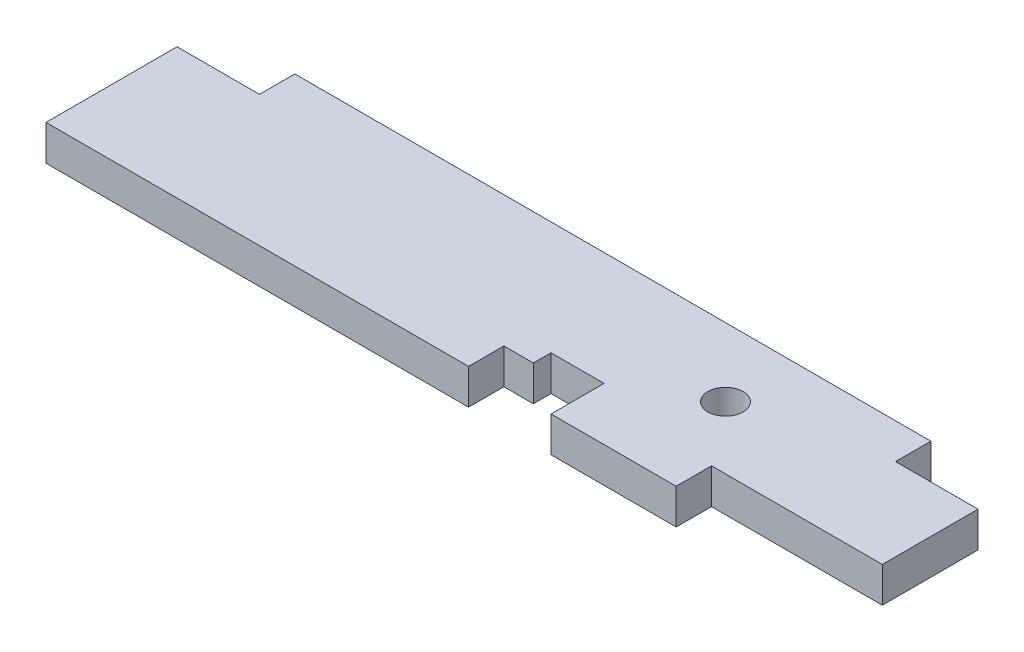
ISO-10303-21;
HEADER;
FILE_DESCRIPTION(('STEP AP214'),'2;1');
FILE_NAME('part.step','',(''),(''),'','','');
FILE_SCHEMA(('AUTOMOTIVE_DESIGN { 1 0 10303 214 1 1 1 1 }'));
ENDSEC;
DATA;
#1=APPLICATION_CONTEXT('core data for automotive mechanical design processes');
#2=APPLICATION_PROTOCOL_DEFINITION('international standard','automotive_design',2000,#1);
#3=PRODUCT_CONTEXT('',#1,'mechanical');
#4=PRODUCT('Part','Part','',(#3));
#5=PRODUCT_RELATED_PRODUCT_CATEGORY('part','',(#4));
#6=PRODUCT_DEFINITION_FORMATION('','',#4);
#7=PRODUCT_DEFINITION_CONTEXT('part definition',#1,'design');
#8=PRODUCT_DEFINITION('design','',#6,#7);
#9=PRODUCT_DEFINITION_SHAPE('','',#8);
#10=(LENGTH_UNIT() NAMED_UNIT(*) SI_UNIT(.MILLI.,.METRE.));
#11=(NAMED_UNIT(*) PLANE_ANGLE_UNIT() SI_UNIT($,.RADIAN.));
#12=(NAMED_UNIT(*) SI_UNIT($,.STERADIAN.) SOLID_ANGLE_UNIT());
#13=UNCERTAINTY_MEASURE_WITH_UNIT(LENGTH_MEASURE(1.E-05),#10,'distance_accuracy_value','');
#14=(GEOMETRIC_REPRESENTATION_CONTEXT(3) GLOBAL_UNCERTAINTY_ASSIGNED_CONTEXT((#13)) GLOBAL_UNIT_ASSIGNED_CONTEXT((#10,
#11,#12)) REPRESENTATION_CONTEXT('',''));
#15=CARTESIAN_POINT('',(0.,0.,0.));
#16=DIRECTION('',(0.,0.,1.));
#17=DIRECTION('',(1.,0.,0.));
#18=AXIS2_PLACEMENT_3D('',#15,#16,#17);
#19=CARTESIAN_POINT('',(0.,38.1,179.3875));
#20=DIRECTION('',(0.,0.,-1.));
#21=DIRECTION('',(-1.,0.,0.));
#22=AXIS2_PLACEMENT_3D('',#19,#20,#21);
#23=PLANE('',#22);
#24=DIRECTION('',(1.,0.,0.));
#25=VECTOR('',#24,1.);
#26=CARTESIAN_POINT('',(0.,0.,179.3875));
#27=LINE('',#26,#25);
#28=CARTESIAN_POINT('',(0.,0.,179.3875));
#29=VERTEX_POINT('',#28);
#30=CARTESIAN_POINT('',(455.6125,0.,179.3875));
#31=VERTEX_POINT('',#30);
#32=EDGE_CURVE('E298',#29,#31,#27,.T.);
#33=ORIENTED_EDGE('',*,*,#32,.T.);
#34=DIRECTION('',(0.,1.,0.));
#35=VECTOR('',#34,1.);
#36=CARTESIAN_POINT('',(455.6125,0.,179.3875));
#37=LINE('',#36,#35);
#38=CARTESIAN_POINT('',(455.6125,38.1,179.3875));
#39=VERTEX_POINT('',#38);
#40=EDGE_CURVE('E229',#31,#39,#37,.T.);
#41=ORIENTED_EDGE('',*,*,#40,.T.);
#42=DIRECTION('',(1.,0.,0.));
#43=VECTOR('',#42,1.);
#44=CARTESIAN_POINT('',(0.,38.1,179.3875));
#45=LINE('',#44,#43);
#46=CARTESIAN_POINT('',(0.,38.1,179.3875));
#47=VERTEX_POINT('',#46);
#48=EDGE_CURVE('E279',#47,#39,#45,.T.);
#49=ORIENTED_EDGE('',*,*,#48,.F.);
#50=DIRECTION('',(0.,-1.,0.));
#51=VECTOR('',#50,1.);
#52=CARTESIAN_POINT('',(0.,38.1,179.3875));
#53=LINE('',#52,#51);
#54=EDGE_CURVE('E11',#47,#29,#53,.T.);
#55=ORIENTED_EDGE('',*,*,#54,.T.);
#56=EDGE_LOOP('',(#33,#41,#49,#55));
#57=FACE_BOUND('',#56,.T.);
#58=ADVANCED_FACE('F43',(#57),#23,.F.);
#59=CARTESIAN_POINT('',(0.,38.1,0.));
#60=DIRECTION('',(0.,1.,0.));
#61=DIRECTION('',(0.,0.,1.));
#62=AXIS2_PLACEMENT_3D('',#59,#60,#61);
#63=PLANE('',#62);
#64=DIRECTION('',(-1.,0.,0.));
#65=VECTOR('',#64,1.);
#66=CARTESIAN_POINT('',(0.,38.1,38.1));
#67=LINE('',#66,#65);
#68=CARTESIAN_POINT('',(88.9,38.1,38.1));
#69=VERTEX_POINT('',#68);
#70=CARTESIAN_POINT('',(0.,38.1,38.1));
#71=VERTEX_POINT('',#70);
#72=EDGE_CURVE('E166',#69,#71,#67,.T.);
#73=ORIENTED_EDGE('',*,*,#72,.T.);
#74=DIRECTION('',(0.,0.,1.));
#75=VECTOR('',#74,1.);
#76=CARTESIAN_POINT('',(0.,38.1,0.));
#77=LINE('',#76,#75);
#78=EDGE_CURVE('E274',#71,#47,#77,.T.);
#79=ORIENTED_EDGE('',*,*,#78,.T.);
#80=ORIENTED_EDGE('',*,*,#48,.T.);
#81=DIRECTION('',(0.,0.,1.));
#82=VECTOR('',#81,1.);
#83=CARTESIAN_POINT('',(455.6125,38.1,141.2875));
#84=LINE('',#83,#82);
#85=CARTESIAN_POINT('',(455.6125,38.1,141.2875));
#86=VERTEX_POINT('',#85);
#87=EDGE_CURVE('E201',#86,#39,#84,.T.);
#88=ORIENTED_EDGE('',*,*,#87,.F.);
#89=DIRECTION('',(-1.,0.,0.));
#90=VECTOR('',#89,1.);
#91=CARTESIAN_POINT('',(455.6125,38.1,141.2875));
#92=LINE('',#91,#90);
#93=CARTESIAN_POINT('',(487.3625,38.1,141.2875));
#94=VERTEX_POINT('',#93);
#95=EDGE_CURVE('E213',#94,#86,#92,.T.);
#96=ORIENTED_EDGE('',*,*,#95,.F.);
#97=DIRECTION('',(0.,0.,1.));
#98=VECTOR('',#97,1.);
#99=CARTESIAN_POINT('',(487.3625,38.1,141.2875));
#100=LINE('',#99,#98);
#101=CARTESIAN_POINT('',(487.3625,38.1,122.2375));
#102=VERTEX_POINT('',#101);
#103=EDGE_CURVE('E240',#102,#94,#100,.T.);
#104=ORIENTED_EDGE('',*,*,#103,.F.);
#105=DIRECTION('',(-1.,0.,0.));
#106=VECTOR('',#105,1.);
#107=CARTESIAN_POINT('',(544.5125,38.1,122.2375));
#108=LINE('',#107,#106);
#109=CARTESIAN_POINT('',(544.5125,38.1,122.2375));
#110=VERTEX_POINT('',#109);
#111=EDGE_CURVE('E236',#110,#102,#108,.T.);
#112=ORIENTED_EDGE('',*,*,#111,.F.);
#113=DIRECTION('',(0.,0.,-1.));
#114=VECTOR('',#113,1.);
#115=CARTESIAN_POINT('',(544.5125,38.1,179.3875));
#116=LINE('',#115,#114);
#117=CARTESIAN_POINT('',(544.5125,38.1,179.3875));
#118=VERTEX_POINT('',#117);
#119=EDGE_CURVE('E232',#118,#110,#116,.T.);
#120=ORIENTED_EDGE('',*,*,#119,.F.);
#121=CARTESIAN_POINT('',(679.45,38.1,179.3875));
#122=VERTEX_POINT('',#121);
#123=EDGE_CURVE('E277',#118,#122,#45,.T.);
#124=ORIENTED_EDGE('',*,*,#123,.T.);
#125=DIRECTION('',(0.,0.,1.));
#126=VECTOR('',#125,1.);
#127=CARTESIAN_POINT('',(679.45,38.1,179.3875));
#128=LINE('',#127,#126);
#129=CARTESIAN_POINT('',(679.45,38.1,141.2748));
#130=VERTEX_POINT('',#129);
#131=EDGE_CURVE('E182',#130,#122,#128,.T.);
#132=ORIENTED_EDGE('',*,*,#131,.F.);
#133=DIRECTION('',(-1.,0.,0.));
#134=VECTOR('',#133,1.);
#135=CARTESIAN_POINT('',(679.45,38.1,141.2748));
#136=LINE('',#135,#134);
#137=CARTESIAN_POINT('',(863.6,38.1,141.2748));
#138=VERTEX_POINT('',#137);
#139=EDGE_CURVE('E189',#138,#130,#136,.T.);
#140=ORIENTED_EDGE('',*,*,#139,.F.);
#141=DIRECTION('',(0.,0.,-1.));
#142=VECTOR('',#141,1.);
#143=CARTESIAN_POINT('',(863.6,38.1,38.1));
#144=LINE('',#143,#142);
#145=CARTESIAN_POINT('',(863.6,38.1,38.1));
#146=VERTEX_POINT('',#145);
#147=EDGE_CURVE('E283',#138,#146,#144,.T.);
#148=ORIENTED_EDGE('',*,*,#147,.T.);
#149=DIRECTION('',(-1.,0.,0.));
#150=VECTOR('',#149,1.);
#151=CARTESIAN_POINT('',(774.7,38.1,38.1));
#152=LINE('',#151,#150);
#153=CARTESIAN_POINT('',(774.7,38.1,38.1));
#154=VERTEX_POINT('',#153);
#155=EDGE_CURVE('E286',#146,#154,#152,.T.);
#156=ORIENTED_EDGE('',*,*,#155,.T.);
#157=DIRECTION('',(0.,0.,-1.));
#158=VECTOR('',#157,1.);
#159=CARTESIAN_POINT('',(774.7,38.1,0.));
#160=LINE('',#159,#158);
#161=CARTESIAN_POINT('',(774.7,38.1,0.));
#162=VERTEX_POINT('',#161);
#163=EDGE_CURVE('E289',#154,#162,#160,.T.);
#164=ORIENTED_EDGE('',*,*,#163,.T.);
#165=DIRECTION('',(-1.,0.,0.));
#166=VECTOR('',#165,1.);
#167=CARTESIAN_POINT('',(0.,38.1,0.));
#168=LINE('',#167,#166);
#169=CARTESIAN_POINT('',(88.9,38.1,0.));
#170=VERTEX_POINT('',#169);
#171=EDGE_CURVE('E176',#162,#170,#168,.T.);
#172=ORIENTED_EDGE('',*,*,#171,.T.);
#173=DIRECTION('',(0.,0.,1.));
#174=VECTOR('',#173,1.);
#175=CARTESIAN_POINT('',(88.9,38.1,0.));
#176=LINE('',#175,#174);
#177=EDGE_CURVE('E59',#170,#69,#176,.T.);
#178=ORIENTED_EDGE('',*,*,#177,.T.);
#179=EDGE_LOOP('',(#73,#79,#80,#88,#96,#104,#112,#120,#124,#132,#140,#148,#156,#164,#172,#178));
#180=FACE_BOUND('',#179,.T.);
#181=CARTESIAN_POINT('',(627.126,38.1,73.914));
#182=DIRECTION('',(0.,1.,0.));
#183=DIRECTION('',(0.,0.,1.));
#184=AXIS2_PLACEMENT_3D('',#181,#182,#183);
#185=CIRCLE('',#184,19.05);
#186=CARTESIAN_POINT('',(627.126,38.1,92.964));
#187=VERTEX_POINT('',#186);
#188=EDGE_CURVE('E266',#187,#187,#185,.T.);
#189=ORIENTED_EDGE('',*,*,#188,.F.);
#190=EDGE_LOOP('',(#189));
#191=FACE_BOUND('',#190,.T.);
#192=ADVANCED_FACE('F173',(#180,#191),#63,.T.);
#193=CARTESIAN_POINT('',(0.,0.,0.));
#194=DIRECTION('',(0.,1.,0.));
#195=DIRECTION('',(0.,0.,1.));
#196=AXIS2_PLACEMENT_3D('',#193,#194,#195);
#197=PLANE('',#196);
#198=DIRECTION('',(0.,0.,1.));
#199=VECTOR('',#198,1.);
#200=CARTESIAN_POINT('',(0.,0.,0.));
#201=LINE('',#200,#199);
#202=CARTESIAN_POINT('',(0.,0.,38.1));
#203=VERTEX_POINT('',#202);
#204=EDGE_CURVE('E270',#203,#29,#201,.T.);
#205=ORIENTED_EDGE('',*,*,#204,.F.);
#206=DIRECTION('',(-1.,0.,0.));
#207=VECTOR('',#206,1.);
#208=CARTESIAN_POINT('',(0.,0.,38.1));
#209=LINE('',#208,#207);
#210=CARTESIAN_POINT('',(88.9,0.,38.1));
#211=VERTEX_POINT('',#210);
#212=EDGE_CURVE('E177',#211,#203,#209,.T.);
#213=ORIENTED_EDGE('',*,*,#212,.F.);
#214=DIRECTION('',(0.,0.,1.));
#215=VECTOR('',#214,1.);
#216=CARTESIAN_POINT('',(88.9,0.,0.));
#217=LINE('',#216,#215);
#218=CARTESIAN_POINT('',(88.9,0.,0.));
#219=VERTEX_POINT('',#218);
#220=EDGE_CURVE('E159',#219,#211,#217,.T.);
#221=ORIENTED_EDGE('',*,*,#220,.F.);
#222=DIRECTION('',(-1.,0.,0.));
#223=VECTOR('',#222,1.);
#224=CARTESIAN_POINT('',(0.,0.,0.));
#225=LINE('',#224,#223);
#226=CARTESIAN_POINT('',(774.7,0.,0.));
#227=VERTEX_POINT('',#226);
#228=EDGE_CURVE('E278',#227,#219,#225,.T.);
#229=ORIENTED_EDGE('',*,*,#228,.F.);
#230=DIRECTION('',(0.,0.,-1.));
#231=VECTOR('',#230,1.);
#232=CARTESIAN_POINT('',(774.7,0.,0.));
#233=LINE('',#232,#231);
#234=CARTESIAN_POINT('',(774.7,0.,38.1));
#235=VERTEX_POINT('',#234);
#236=EDGE_CURVE('E308',#235,#227,#233,.T.);
#237=ORIENTED_EDGE('',*,*,#236,.F.);
#238=DIRECTION('',(-1.,0.,0.));
#239=VECTOR('',#238,1.);
#240=CARTESIAN_POINT('',(774.7,0.,38.1));
#241=LINE('',#240,#239);
#242=CARTESIAN_POINT('',(863.6,0.,38.1));
#243=VERTEX_POINT('',#242);
#244=EDGE_CURVE('E305',#243,#235,#241,.T.);
#245=ORIENTED_EDGE('',*,*,#244,.F.);
#246=DIRECTION('',(0.,0.,-1.));
#247=VECTOR('',#246,1.);
#248=CARTESIAN_POINT('',(863.6,0.,38.1));
#249=LINE('',#248,#247);
#250=CARTESIAN_POINT('',(863.6,0.,141.2748));
#251=VERTEX_POINT('',#250);
#252=EDGE_CURVE('E302',#251,#243,#249,.T.);
#253=ORIENTED_EDGE('',*,*,#252,.F.);
#254=DIRECTION('',(-1.,0.,0.));
#255=VECTOR('',#254,1.);
#256=CARTESIAN_POINT('',(679.45,0.,141.2748));
#257=LINE('',#256,#255);
#258=CARTESIAN_POINT('',(679.45,0.,141.2748));
#259=VERTEX_POINT('',#258);
#260=EDGE_CURVE('E67',#251,#259,#257,.T.);
#261=ORIENTED_EDGE('',*,*,#260,.T.);
#262=DIRECTION('',(0.,0.,1.));
#263=VECTOR('',#262,1.);
#264=CARTESIAN_POINT('',(679.45,0.,179.3875));
#265=LINE('',#264,#263);
#266=CARTESIAN_POINT('',(679.45,0.,179.3875));
#267=VERTEX_POINT('',#266);
#268=EDGE_CURVE('E185',#259,#267,#265,.T.);
#269=ORIENTED_EDGE('',*,*,#268,.T.);
#270=CARTESIAN_POINT('',(544.5125,0.,179.3875));
#271=VERTEX_POINT('',#270);
#272=EDGE_CURVE('E297',#271,#267,#27,.T.);
#273=ORIENTED_EDGE('',*,*,#272,.F.);
#274=DIRECTION('',(0.,0.,-1.));
#275=VECTOR('',#274,1.);
#276=CARTESIAN_POINT('',(544.5125,0.,179.3875));
#277=LINE('',#276,#275);
#278=CARTESIAN_POINT('',(544.5125,0.,122.2375));
#279=VERTEX_POINT('',#278);
#280=EDGE_CURVE('E212',#271,#279,#277,.T.);
#281=ORIENTED_EDGE('',*,*,#280,.T.);
#282=DIRECTION('',(-1.,0.,0.));
#283=VECTOR('',#282,1.);
#284=CARTESIAN_POINT('',(544.5125,0.,122.2375));
#285=LINE('',#284,#283);
#286=CARTESIAN_POINT('',(487.3625,0.,122.2375));
#287=VERTEX_POINT('',#286);
#288=EDGE_CURVE('E217',#279,#287,#285,.T.);
#289=ORIENTED_EDGE('',*,*,#288,.T.);
#290=DIRECTION('',(0.,0.,1.));
#291=VECTOR('',#290,1.);
#292=CARTESIAN_POINT('',(487.3625,0.,141.2875));
#293=LINE('',#292,#291);
#294=CARTESIAN_POINT('',(487.3625,0.,141.2875));
#295=VERTEX_POINT('',#294);
#296=EDGE_CURVE('E221',#287,#295,#293,.T.);
#297=ORIENTED_EDGE('',*,*,#296,.T.);
#298=DIRECTION('',(-1.,0.,0.));
#299=VECTOR('',#298,1.);
#300=CARTESIAN_POINT('',(455.6125,0.,141.2875));
#301=LINE('',#300,#299);
#302=CARTESIAN_POINT('',(455.6125,0.,141.2875));
#303=VERTEX_POINT('',#302);
#304=EDGE_CURVE('E225',#295,#303,#301,.T.);
#305=ORIENTED_EDGE('',*,*,#304,.T.);
#306=DIRECTION('',(0.,0.,1.));
#307=VECTOR('',#306,1.);
#308=CARTESIAN_POINT('',(455.6125,0.,141.2875));
#309=LINE('',#308,#307);
#310=EDGE_CURVE('E208',#303,#31,#309,.T.);
#311=ORIENTED_EDGE('',*,*,#310,.T.);
#312=ORIENTED_EDGE('',*,*,#32,.F.);
#313=EDGE_LOOP('',(#205,#213,#221,#229,#237,#245,#253,#261,#269,#273,#281,#289,#297,#305,#311,#312));
#314=FACE_BOUND('',#313,.T.);
#315=CARTESIAN_POINT('',(627.126,0.,73.914));
#316=DIRECTION('',(0.,1.,0.));
#317=DIRECTION('',(0.,0.,1.));
#318=AXIS2_PLACEMENT_3D('',#315,#316,#317);
#319=CIRCLE('',#318,19.05);
#320=CARTESIAN_POINT('',(627.126,0.,92.964));
#321=VERTEX_POINT('',#320);
#322=EDGE_CURVE('E250',#321,#321,#319,.T.);
#323=ORIENTED_EDGE('',*,*,#322,.T.);
#324=EDGE_LOOP('',(#323));
#325=FACE_BOUND('',#324,.T.);
#326=ADVANCED_FACE('F335',(#314,#325),#197,.F.);
#327=CARTESIAN_POINT('',(0.,38.1,0.));
#328=DIRECTION('',(1.,0.,0.));
#329=DIRECTION('',(0.,0.,-1.));
#330=AXIS2_PLACEMENT_3D('',#327,#328,#329);
#331=PLANE('',#330);
#332=ORIENTED_EDGE('',*,*,#78,.F.);
#333=DIRECTION('',(0.,-1.,0.));
#334=VECTOR('',#333,1.);
#335=CARTESIAN_POINT('',(0.,38.1,38.1));
#336=LINE('',#335,#334);
#337=EDGE_CURVE('E162',#71,#203,#336,.T.);
#338=ORIENTED_EDGE('',*,*,#337,.T.);
#339=ORIENTED_EDGE('',*,*,#204,.T.);
#340=ORIENTED_EDGE('',*,*,#54,.F.);
#341=EDGE_LOOP('',(#332,#338,#339,#340));
#342=FACE_BOUND('',#341,.T.);
#343=ADVANCED_FACE('F45',(#342),#331,.F.);
#344=ORIENTED_EDGE('',*,*,#272,.T.);
#345=DIRECTION('',(0.,1.,0.));
#346=VECTOR('',#345,1.);
#347=CARTESIAN_POINT('',(679.45,0.,179.3875));
#348=LINE('',#347,#346);
#349=EDGE_CURVE('E192',#267,#122,#348,.T.);
#350=ORIENTED_EDGE('',*,*,#349,.T.);
#351=ORIENTED_EDGE('',*,*,#123,.F.);
#352=DIRECTION('',(0.,1.,0.));
#353=VECTOR('',#352,1.);
#354=CARTESIAN_POINT('',(544.5125,0.,179.3875));
#355=LINE('',#354,#353);
#356=EDGE_CURVE('E260',#271,#118,#355,.T.);
#357=ORIENTED_EDGE('',*,*,#356,.F.);
#358=EDGE_LOOP('',(#344,#350,#351,#357));
#359=FACE_BOUND('',#358,.T.);
#360=ADVANCED_FACE('F374',(#359),#23,.F.);
#361=CARTESIAN_POINT('',(863.6,38.1,38.1));
#362=DIRECTION('',(-1.,0.,0.));
#363=DIRECTION('',(0.,0.,1.));
#364=AXIS2_PLACEMENT_3D('',#361,#362,#363);
#365=PLANE('',#364);
#366=ORIENTED_EDGE('',*,*,#147,.F.);
#367=DIRECTION('',(0.,1.,0.));
#368=VECTOR('',#367,1.);
#369=CARTESIAN_POINT('',(863.6,0.,141.2748));
#370=LINE('',#369,#368);
#371=EDGE_CURVE('E202',#251,#138,#370,.T.);
#372=ORIENTED_EDGE('',*,*,#371,.F.);
#373=ORIENTED_EDGE('',*,*,#252,.T.);
#374=DIRECTION('',(0.,-1.,0.));
#375=VECTOR('',#374,1.);
#376=CARTESIAN_POINT('',(863.6,38.1,38.1));
#377=LINE('',#376,#375);
#378=EDGE_CURVE('E52',#146,#243,#377,.T.);
#379=ORIENTED_EDGE('',*,*,#378,.F.);
#380=EDGE_LOOP('',(#366,#372,#373,#379));
#381=FACE_BOUND('',#380,.T.);
#382=ADVANCED_FACE('F417',(#381),#365,.F.);
#383=CARTESIAN_POINT('',(774.7,38.1,38.1));
#384=DIRECTION('',(0.,0.,1.));
#385=DIRECTION('',(1.,0.,0.));
#386=AXIS2_PLACEMENT_3D('',#383,#384,#385);
#387=PLANE('',#386);
#388=ORIENTED_EDGE('',*,*,#244,.T.);
#389=DIRECTION('',(0.,-1.,0.));
#390=VECTOR('',#389,1.);
#391=CARTESIAN_POINT('',(774.7,38.1,38.1));
#392=LINE('',#391,#390);
#393=EDGE_CURVE('E317',#154,#235,#392,.T.);
#394=ORIENTED_EDGE('',*,*,#393,.F.);
#395=ORIENTED_EDGE('',*,*,#155,.F.);
#396=ORIENTED_EDGE('',*,*,#378,.T.);
#397=EDGE_LOOP('',(#388,#394,#395,#396));
#398=FACE_BOUND('',#397,.T.);
#399=ADVANCED_FACE('F327',(#398),#387,.F.);
#400=CARTESIAN_POINT('',(774.7,38.1,0.));
#401=DIRECTION('',(-1.,0.,0.));
#402=DIRECTION('',(0.,0.,1.));
#403=AXIS2_PLACEMENT_3D('',#400,#401,#402);
#404=PLANE('',#403);
#405=ORIENTED_EDGE('',*,*,#236,.T.);
#406=DIRECTION('',(0.,-1.,0.));
#407=VECTOR('',#406,1.);
#408=CARTESIAN_POINT('',(774.7,38.1,0.));
#409=LINE('',#408,#407);
#410=EDGE_CURVE('E294',#162,#227,#409,.T.);
#411=ORIENTED_EDGE('',*,*,#410,.F.);
#412=ORIENTED_EDGE('',*,*,#163,.F.);
#413=ORIENTED_EDGE('',*,*,#393,.T.);
#414=EDGE_LOOP('',(#405,#411,#412,#413));
#415=FACE_BOUND('',#414,.T.);
#416=ADVANCED_FACE('F340',(#415),#404,.F.);
#417=CARTESIAN_POINT('',(0.,38.1,0.));
#418=DIRECTION('',(0.,0.,1.));
#419=DIRECTION('',(1.,0.,0.));
#420=AXIS2_PLACEMENT_3D('',#417,#418,#419);
#421=PLANE('',#420);
#422=ORIENTED_EDGE('',*,*,#228,.T.);
#423=DIRECTION('',(0.,-1.,0.));
#424=VECTOR('',#423,1.);
#425=CARTESIAN_POINT('',(88.9,38.1,0.));
#426=LINE('',#425,#424);
#427=EDGE_CURVE('E163',#170,#219,#426,.T.);
#428=ORIENTED_EDGE('',*,*,#427,.F.);
#429=ORIENTED_EDGE('',*,*,#171,.F.);
#430=ORIENTED_EDGE('',*,*,#410,.T.);
#431=EDGE_LOOP('',(#422,#428,#429,#430));
#432=FACE_BOUND('',#431,.T.);
#433=ADVANCED_FACE('F343',(#432),#421,.F.);
#434=CARTESIAN_POINT('',(627.126,38.1,73.914));
#435=DIRECTION('',(0.,-1.,0.));
#436=DIRECTION('',(0.,0.,-1.));
#437=AXIS2_PLACEMENT_3D('',#434,#435,#436);
#438=CYLINDRICAL_SURFACE('',#437,19.05);
#439=ORIENTED_EDGE('',*,*,#188,.T.);
#440=EDGE_LOOP('',(#439));
#441=FACE_BOUND('',#440,.T.);
#442=ORIENTED_EDGE('',*,*,#322,.F.);
#443=EDGE_LOOP('',(#442));
#444=FACE_BOUND('',#443,.T.);
#445=ADVANCED_FACE('F452',(#441,#444),#438,.F.);
#446=CARTESIAN_POINT('',(455.6125,0.,141.2875));
#447=DIRECTION('',(-1.,0.,0.));
#448=DIRECTION('',(0.,0.,1.));
#449=AXIS2_PLACEMENT_3D('',#446,#447,#448);
#450=PLANE('',#449);
#451=ORIENTED_EDGE('',*,*,#87,.T.);
#452=ORIENTED_EDGE('',*,*,#40,.F.);
#453=ORIENTED_EDGE('',*,*,#310,.F.);
#454=DIRECTION('',(0.,1.,0.));
#455=VECTOR('',#454,1.);
#456=CARTESIAN_POINT('',(455.6125,0.,141.2875));
#457=LINE('',#456,#455);
#458=EDGE_CURVE('E247',#303,#86,#457,.T.);
#459=ORIENTED_EDGE('',*,*,#458,.T.);
#460=EDGE_LOOP('',(#451,#452,#453,#459));
#461=FACE_BOUND('',#460,.T.);
#462=ADVANCED_FACE('F352',(#461),#450,.F.);
#463=CARTESIAN_POINT('',(455.6125,0.,141.2875));
#464=DIRECTION('',(0.,0.,-1.));
#465=DIRECTION('',(-1.,0.,0.));
#466=AXIS2_PLACEMENT_3D('',#463,#464,#465);
#467=PLANE('',#466);
#468=ORIENTED_EDGE('',*,*,#95,.T.);
#469=ORIENTED_EDGE('',*,*,#458,.F.);
#470=ORIENTED_EDGE('',*,*,#304,.F.);
#471=DIRECTION('',(0.,1.,0.));
#472=VECTOR('',#471,1.);
#473=CARTESIAN_POINT('',(487.3625,0.,141.2875));
#474=LINE('',#473,#472);
#475=EDGE_CURVE('E251',#295,#94,#474,.T.);
#476=ORIENTED_EDGE('',*,*,#475,.T.);
#477=EDGE_LOOP('',(#468,#469,#470,#476));
#478=FACE_BOUND('',#477,.T.);
#479=ADVANCED_FACE('F356',(#478),#467,.F.);
#480=CARTESIAN_POINT('',(487.3625,0.,141.2875));
#481=DIRECTION('',(-1.,0.,0.));
#482=DIRECTION('',(0.,0.,1.));
#483=AXIS2_PLACEMENT_3D('',#480,#481,#482);
#484=PLANE('',#483);
#485=ORIENTED_EDGE('',*,*,#103,.T.);
#486=ORIENTED_EDGE('',*,*,#475,.F.);
#487=ORIENTED_EDGE('',*,*,#296,.F.);
#488=DIRECTION('',(0.,1.,0.));
#489=VECTOR('',#488,1.);
#490=CARTESIAN_POINT('',(487.3625,0.,122.2375));
#491=LINE('',#490,#489);
#492=EDGE_CURVE('E254',#287,#102,#491,.T.);
#493=ORIENTED_EDGE('',*,*,#492,.T.);
#494=EDGE_LOOP('',(#485,#486,#487,#493));
#495=FACE_BOUND('',#494,.T.);
#496=ADVANCED_FACE('F362',(#495),#484,.F.);
#497=CARTESIAN_POINT('',(544.5125,0.,122.2375));
#498=DIRECTION('',(0.,0.,-1.));
#499=DIRECTION('',(-1.,0.,0.));
#500=AXIS2_PLACEMENT_3D('',#497,#498,#499);
#501=PLANE('',#500);
#502=ORIENTED_EDGE('',*,*,#111,.T.);
#503=ORIENTED_EDGE('',*,*,#492,.F.);
#504=ORIENTED_EDGE('',*,*,#288,.F.);
#505=DIRECTION('',(0.,1.,0.));
#506=VECTOR('',#505,1.);
#507=CARTESIAN_POINT('',(544.5125,0.,122.2375));
#508=LINE('',#507,#506);
#509=EDGE_CURVE('E257',#279,#110,#508,.T.);
#510=ORIENTED_EDGE('',*,*,#509,.T.);
#511=EDGE_LOOP('',(#502,#503,#504,#510));
#512=FACE_BOUND('',#511,.T.);
#513=ADVANCED_FACE('F365',(#512),#501,.F.);
#514=CARTESIAN_POINT('',(544.5125,0.,179.3875));
#515=DIRECTION('',(1.,0.,0.));
#516=DIRECTION('',(0.,0.,-1.));
#517=AXIS2_PLACEMENT_3D('',#514,#515,#516);
#518=PLANE('',#517);
#519=ORIENTED_EDGE('',*,*,#119,.T.);
#520=ORIENTED_EDGE('',*,*,#509,.F.);
#521=ORIENTED_EDGE('',*,*,#280,.F.);
#522=ORIENTED_EDGE('',*,*,#356,.T.);
#523=EDGE_LOOP('',(#519,#520,#521,#522));
#524=FACE_BOUND('',#523,.T.);
#525=ADVANCED_FACE('F367',(#524),#518,.F.);
#526=CARTESIAN_POINT('',(679.45,0.,179.3875));
#527=DIRECTION('',(-1.,0.,0.));
#528=DIRECTION('',(0.,0.,1.));
#529=AXIS2_PLACEMENT_3D('',#526,#527,#528);
#530=PLANE('',#529);
#531=ORIENTED_EDGE('',*,*,#131,.T.);
#532=ORIENTED_EDGE('',*,*,#349,.F.);
#533=ORIENTED_EDGE('',*,*,#268,.F.);
#534=DIRECTION('',(0.,1.,0.));
#535=VECTOR('',#534,1.);
#536=CARTESIAN_POINT('',(679.45,0.,141.2748));
#537=LINE('',#536,#535);
#538=EDGE_CURVE('E198',#259,#130,#537,.T.);
#539=ORIENTED_EDGE('',*,*,#538,.T.);
#540=EDGE_LOOP('',(#531,#532,#533,#539));
#541=FACE_BOUND('',#540,.T.);
#542=ADVANCED_FACE('F415',(#541),#530,.F.);
#543=CARTESIAN_POINT('',(679.45,0.,141.2748));
#544=DIRECTION('',(0.,0.,-1.));
#545=DIRECTION('',(-1.,0.,0.));
#546=AXIS2_PLACEMENT_3D('',#543,#544,#545);
#547=PLANE('',#546);
#548=ORIENTED_EDGE('',*,*,#139,.T.);
#549=ORIENTED_EDGE('',*,*,#538,.F.);
#550=ORIENTED_EDGE('',*,*,#260,.F.);
#551=ORIENTED_EDGE('',*,*,#371,.T.);
#552=EDGE_LOOP('',(#548,#549,#550,#551));
#553=FACE_BOUND('',#552,.T.);
#554=ADVANCED_FACE('F418',(#553),#547,.F.);
#555=CARTESIAN_POINT('',(0.,38.1,38.1));
#556=DIRECTION('',(0.,0.,1.));
#557=DIRECTION('',(1.,0.,0.));
#558=AXIS2_PLACEMENT_3D('',#555,#556,#557);
#559=PLANE('',#558);
#560=ORIENTED_EDGE('',*,*,#212,.T.);
#561=ORIENTED_EDGE('',*,*,#337,.F.);
#562=ORIENTED_EDGE('',*,*,#72,.F.);
#563=DIRECTION('',(0.,-1.,0.));
#564=VECTOR('',#563,1.);
#565=CARTESIAN_POINT('',(88.9,38.1,38.1));
#566=LINE('',#565,#564);
#567=EDGE_CURVE('E155',#69,#211,#566,.T.);
#568=ORIENTED_EDGE('',*,*,#567,.T.);
#569=EDGE_LOOP('',(#560,#561,#562,#568));
#570=FACE_BOUND('',#569,.T.);
#571=ADVANCED_FACE('F167',(#570),#559,.F.);
#572=CARTESIAN_POINT('',(88.9,38.1,0.));
#573=DIRECTION('',(1.,0.,0.));
#574=DIRECTION('',(0.,0.,-1.));
#575=AXIS2_PLACEMENT_3D('',#572,#573,#574);
#576=PLANE('',#575);
#577=ORIENTED_EDGE('',*,*,#220,.T.);
#578=ORIENTED_EDGE('',*,*,#567,.F.);
#579=ORIENTED_EDGE('',*,*,#177,.F.);
#580=ORIENTED_EDGE('',*,*,#427,.T.);
#581=EDGE_LOOP('',(#577,#578,#579,#580));
#582=FACE_BOUND('',#581,.T.);
#583=ADVANCED_FACE('F157',(#582),#576,.F.);
#584=CLOSED_SHELL('',(#58,#192,#326,#343,#360,#382,#399,#416,#433,#445,#462,#479,#496,#513,#525,
#542,#554,#571,#583));
#585=MANIFOLD_SOLID_BREP('B2',#584);
#586=ADVANCED_BREP_SHAPE_REPRESENTATION('',(#18,#585),#14);
#587=SHAPE_DEFINITION_REPRESENTATION(#9,#586);
ENDSEC;
END-ISO-10303-21;
